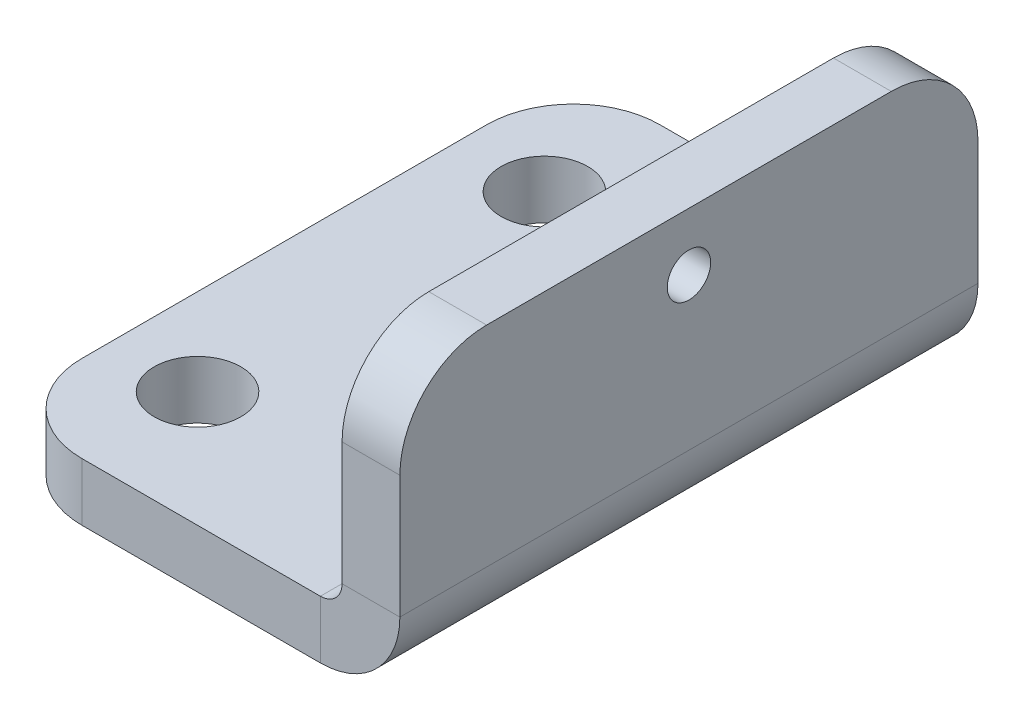
ISO-10303-21;
HEADER;
FILE_DESCRIPTION(('STEP AP214'),'2;1');
FILE_NAME('part.step','',(''),(''),'','','');
FILE_SCHEMA(('AUTOMOTIVE_DESIGN { 1 0 10303 214 1 1 1 1 }'));
ENDSEC;
DATA;
#1=APPLICATION_CONTEXT('core data for automotive mechanical design processes');
#2=APPLICATION_PROTOCOL_DEFINITION('international standard','automotive_design',2000,#1);
#3=PRODUCT_CONTEXT('',#1,'mechanical');
#4=PRODUCT('Part','Part','',(#3));
#5=PRODUCT_RELATED_PRODUCT_CATEGORY('part','',(#4));
#6=PRODUCT_DEFINITION_FORMATION('','',#4);
#7=PRODUCT_DEFINITION_CONTEXT('part definition',#1,'design');
#8=PRODUCT_DEFINITION('design','',#6,#7);
#9=PRODUCT_DEFINITION_SHAPE('','',#8);
#10=(LENGTH_UNIT() NAMED_UNIT(*) SI_UNIT(.MILLI.,.METRE.));
#11=(NAMED_UNIT(*) PLANE_ANGLE_UNIT() SI_UNIT($,.RADIAN.));
#12=(NAMED_UNIT(*) SI_UNIT($,.STERADIAN.) SOLID_ANGLE_UNIT());
#13=UNCERTAINTY_MEASURE_WITH_UNIT(LENGTH_MEASURE(1.E-05),#10,'distance_accuracy_value','');
#14=(GEOMETRIC_REPRESENTATION_CONTEXT(3) GLOBAL_UNCERTAINTY_ASSIGNED_CONTEXT((#13)) GLOBAL_UNIT_ASSIGNED_CONTEXT((#10,
#11,#12)) REPRESENTATION_CONTEXT('',''));
#15=CARTESIAN_POINT('',(0.,0.,0.));
#16=DIRECTION('',(0.,0.,1.));
#17=DIRECTION('',(1.,0.,0.));
#18=AXIS2_PLACEMENT_3D('',#15,#16,#17);
#19=CARTESIAN_POINT('',(0.,0.75,10.));
#20=DIRECTION('',(0.,0.,1.));
#21=DIRECTION('',(1.,0.,0.));
#22=AXIS2_PLACEMENT_3D('',#19,#20,#21);
#23=PLANE('',#22);
#24=DIRECTION('',(1.,0.,0.));
#25=VECTOR('',#24,1.);
#26=CARTESIAN_POINT('',(0.,0.75,10.));
#27=LINE('',#26,#25);
#28=CARTESIAN_POINT('',(0.,0.75,10.));
#29=VERTEX_POINT('',#28);
#30=CARTESIAN_POINT('',(2.,0.75,10.));
#31=VERTEX_POINT('',#30);
#32=EDGE_CURVE('E130',#29,#31,#27,.T.);
#33=ORIENTED_EDGE('',*,*,#32,.F.);
#34=CARTESIAN_POINT('',(-0.75,0.75,10.));
#35=DIRECTION('',(0.,0.,-1.));
#36=DIRECTION('',(-1.,0.,0.));
#37=AXIS2_PLACEMENT_3D('',#34,#35,#36);
#38=CIRCLE('',#37,0.75);
#39=CARTESIAN_POINT('',(-0.750000000000001,0.,10.));
#40=VERTEX_POINT('',#39);
#41=EDGE_CURVE('E134',#40,#29,#38,.F.);
#42=ORIENTED_EDGE('',*,*,#41,.F.);
#43=DIRECTION('',(0.,1.,0.));
#44=VECTOR('',#43,1.);
#45=CARTESIAN_POINT('',(-0.750000000000001,-2.,10.));
#46=LINE('',#45,#44);
#47=CARTESIAN_POINT('',(-0.750000000000001,-2.,10.));
#48=VERTEX_POINT('',#47);
#49=EDGE_CURVE('E139',#48,#40,#46,.T.);
#50=ORIENTED_EDGE('',*,*,#49,.F.);
#51=CARTESIAN_POINT('',(-0.75,0.75,10.));
#52=DIRECTION('',(0.,0.,1.));
#53=DIRECTION('',(1.,0.,0.));
#54=AXIS2_PLACEMENT_3D('',#51,#52,#53);
#55=CIRCLE('',#54,2.75);
#56=EDGE_CURVE('E136',#48,#31,#55,.T.);
#57=ORIENTED_EDGE('',*,*,#56,.T.);
#58=EDGE_LOOP('',(#33,#42,#50,#57));
#59=FACE_BOUND('',#58,.T.);
#60=ADVANCED_FACE('F39',(#59),#23,.T.);
#61=CARTESIAN_POINT('',(-0.750000000000001,-2.,10.));
#62=DIRECTION('',(0.,0.,1.));
#63=DIRECTION('',(1.,0.,0.));
#64=AXIS2_PLACEMENT_3D('',#61,#62,#63);
#65=PLANE('',#64);
#66=DIRECTION('',(0.,1.,0.));
#67=VECTOR('',#66,1.);
#68=CARTESIAN_POINT('',(2.,0.,10.));
#69=LINE('',#68,#67);
#70=CARTESIAN_POINT('',(2.,5.,10.));
#71=VERTEX_POINT('',#70);
#72=EDGE_CURVE('E157',#31,#71,#69,.T.);
#73=ORIENTED_EDGE('',*,*,#72,.T.);
#74=DIRECTION('',(1.,0.,0.));
#75=VECTOR('',#74,1.);
#76=CARTESIAN_POINT('',(-0.750000000000001,5.,10.));
#77=LINE('',#76,#75);
#78=CARTESIAN_POINT('',(0.,5.,10.));
#79=VERTEX_POINT('',#78);
#80=EDGE_CURVE('E11',#71,#79,#77,.F.);
#81=ORIENTED_EDGE('',*,*,#80,.T.);
#82=DIRECTION('',(0.,1.,0.));
#83=VECTOR('',#82,1.);
#84=CARTESIAN_POINT('',(0.,0.,10.));
#85=LINE('',#84,#83);
#86=EDGE_CURVE('E146',#29,#79,#85,.T.);
#87=ORIENTED_EDGE('',*,*,#86,.F.);
#88=ORIENTED_EDGE('',*,*,#32,.T.);
#89=EDGE_LOOP('',(#73,#81,#87,#88));
#90=FACE_BOUND('',#89,.T.);
#91=ADVANCED_FACE('F156',(#90),#65,.T.);
#92=CARTESIAN_POINT('',(-0.750000000000001,0.,-10.));
#93=DIRECTION('',(0.,0.,-1.));
#94=DIRECTION('',(-1.,0.,0.));
#95=AXIS2_PLACEMENT_3D('',#92,#93,#94);
#96=PLANE('',#95);
#97=DIRECTION('',(0.,-1.,0.));
#98=VECTOR('',#97,1.);
#99=CARTESIAN_POINT('',(-0.750000000000001,0.,-10.));
#100=LINE('',#99,#98);
#101=CARTESIAN_POINT('',(-0.750000000000001,0.,-10.));
#102=VERTEX_POINT('',#101);
#103=CARTESIAN_POINT('',(-0.750000000000001,-2.,-10.));
#104=VERTEX_POINT('',#103);
#105=EDGE_CURVE('E202',#102,#104,#100,.T.);
#106=ORIENTED_EDGE('',*,*,#105,.F.);
#107=CARTESIAN_POINT('',(-0.75,0.75,-10.));
#108=DIRECTION('',(0.,0.,-1.));
#109=DIRECTION('',(-1.,0.,0.));
#110=AXIS2_PLACEMENT_3D('',#107,#108,#109);
#111=CIRCLE('',#110,0.75);
#112=CARTESIAN_POINT('',(0.,0.75,-10.));
#113=VERTEX_POINT('',#112);
#114=EDGE_CURVE('E176',#102,#113,#111,.F.);
#115=ORIENTED_EDGE('',*,*,#114,.T.);
#116=DIRECTION('',(-1.,0.,0.));
#117=VECTOR('',#116,1.);
#118=CARTESIAN_POINT('',(2.,0.75,-10.));
#119=LINE('',#118,#117);
#120=CARTESIAN_POINT('',(2.,0.75,-10.));
#121=VERTEX_POINT('',#120);
#122=EDGE_CURVE('E200',#121,#113,#119,.T.);
#123=ORIENTED_EDGE('',*,*,#122,.F.);
#124=CARTESIAN_POINT('',(-0.75,0.75,-10.));
#125=DIRECTION('',(0.,0.,1.));
#126=DIRECTION('',(1.,0.,0.));
#127=AXIS2_PLACEMENT_3D('',#124,#125,#126);
#128=CIRCLE('',#127,2.75);
#129=EDGE_CURVE('E182',#104,#121,#128,.T.);
#130=ORIENTED_EDGE('',*,*,#129,.F.);
#131=EDGE_LOOP('',(#106,#115,#123,#130));
#132=FACE_BOUND('',#131,.T.);
#133=ADVANCED_FACE('F291',(#132),#96,.T.);
#134=CARTESIAN_POINT('',(2.,0.75,-10.));
#135=DIRECTION('',(0.,0.,-1.));
#136=DIRECTION('',(-1.,0.,0.));
#137=AXIS2_PLACEMENT_3D('',#134,#135,#136);
#138=PLANE('',#137);
#139=DIRECTION('',(1.,0.,0.));
#140=VECTOR('',#139,1.);
#141=CARTESIAN_POINT('',(-12.,-2.,-10.));
#142=LINE('',#141,#140);
#143=CARTESIAN_POINT('',(-9.,-2.,-10.));
#144=VERTEX_POINT('',#143);
#145=EDGE_CURVE('E180',#144,#104,#142,.T.);
#146=ORIENTED_EDGE('',*,*,#145,.F.);
#147=DIRECTION('',(0.,1.,0.));
#148=VECTOR('',#147,1.);
#149=CARTESIAN_POINT('',(-9.,0.75,-10.));
#150=LINE('',#149,#148);
#151=CARTESIAN_POINT('',(-9.,0.,-10.));
#152=VERTEX_POINT('',#151);
#153=EDGE_CURVE('E138',#144,#152,#150,.T.);
#154=ORIENTED_EDGE('',*,*,#153,.T.);
#155=DIRECTION('',(1.,0.,0.));
#156=VECTOR('',#155,1.);
#157=CARTESIAN_POINT('',(-12.,0.,-10.));
#158=LINE('',#157,#156);
#159=EDGE_CURVE('E178',#152,#102,#158,.T.);
#160=ORIENTED_EDGE('',*,*,#159,.T.);
#161=ORIENTED_EDGE('',*,*,#105,.T.);
#162=EDGE_LOOP('',(#146,#154,#160,#161));
#163=FACE_BOUND('',#162,.T.);
#164=ADVANCED_FACE('F351',(#163),#138,.T.);
#165=CARTESIAN_POINT('',(2.,0.,10.));
#166=DIRECTION('',(-1.,0.,0.));
#167=DIRECTION('',(0.,0.,1.));
#168=AXIS2_PLACEMENT_3D('',#165,#166,#167);
#169=PLANE('',#168);
#170=CARTESIAN_POINT('',(2.,6.,0.));
#171=DIRECTION('',(-1.,0.,0.));
#172=DIRECTION('',(0.,0.,1.));
#173=AXIS2_PLACEMENT_3D('',#170,#171,#172);
#174=CIRCLE('',#173,0.75);
#175=CARTESIAN_POINT('',(2.,6.,0.75));
#176=VERTEX_POINT('',#175);
#177=EDGE_CURVE('E255',#176,#176,#174,.T.);
#178=ORIENTED_EDGE('',*,*,#177,.T.);
#179=EDGE_LOOP('',(#178));
#180=FACE_BOUND('',#179,.T.);
#181=DIRECTION('',(0.,1.,0.));
#182=VECTOR('',#181,1.);
#183=CARTESIAN_POINT('',(2.,0.,-10.));
#184=LINE('',#183,#182);
#185=CARTESIAN_POINT('',(2.,5.,-10.));
#186=VERTEX_POINT('',#185);
#187=EDGE_CURVE('E171',#121,#186,#184,.T.);
#188=ORIENTED_EDGE('',*,*,#187,.T.);
#189=CARTESIAN_POINT('',(2.,5.,-7.));
#190=DIRECTION('',(-1.,0.,0.));
#191=DIRECTION('',(0.,0.,1.));
#192=AXIS2_PLACEMENT_3D('',#189,#190,#191);
#193=CIRCLE('',#192,3.);
#194=CARTESIAN_POINT('',(2.,8.,-7.));
#195=VERTEX_POINT('',#194);
#196=EDGE_CURVE('E229',#186,#195,#193,.F.);
#197=ORIENTED_EDGE('',*,*,#196,.T.);
#198=DIRECTION('',(0.,0.,-1.));
#199=VECTOR('',#198,1.);
#200=CARTESIAN_POINT('',(2.,8.,10.));
#201=LINE('',#200,#199);
#202=CARTESIAN_POINT('',(2.,8.,7.));
#203=VERTEX_POINT('',#202);
#204=EDGE_CURVE('E198',#203,#195,#201,.T.);
#205=ORIENTED_EDGE('',*,*,#204,.F.);
#206=CARTESIAN_POINT('',(2.,5.,7.));
#207=DIRECTION('',(-1.,0.,0.));
#208=DIRECTION('',(0.,0.,1.));
#209=AXIS2_PLACEMENT_3D('',#206,#207,#208);
#210=CIRCLE('',#209,3.);
#211=EDGE_CURVE('E227',#203,#71,#210,.F.);
#212=ORIENTED_EDGE('',*,*,#211,.T.);
#213=ORIENTED_EDGE('',*,*,#72,.F.);
#214=DIRECTION('',(0.,0.,-1.));
#215=VECTOR('',#214,1.);
#216=CARTESIAN_POINT('',(2.,0.75,10.));
#217=LINE('',#216,#215);
#218=EDGE_CURVE('E170',#31,#121,#217,.T.);
#219=ORIENTED_EDGE('',*,*,#218,.T.);
#220=EDGE_LOOP('',(#188,#197,#205,#212,#213,#219));
#221=FACE_BOUND('',#220,.T.);
#222=ADVANCED_FACE('F245',(#180,#221),#169,.F.);
#223=CARTESIAN_POINT('',(0.,8.,10.));
#224=DIRECTION('',(0.,1.,0.));
#225=DIRECTION('',(0.,0.,1.));
#226=AXIS2_PLACEMENT_3D('',#223,#224,#225);
#227=PLANE('',#226);
#228=ORIENTED_EDGE('',*,*,#204,.T.);
#229=DIRECTION('',(1.,0.,0.));
#230=VECTOR('',#229,1.);
#231=CARTESIAN_POINT('',(0.,8.,-7.));
#232=LINE('',#231,#230);
#233=CARTESIAN_POINT('',(0.,8.,-7.));
#234=VERTEX_POINT('',#233);
#235=EDGE_CURVE('E60',#195,#234,#232,.F.);
#236=ORIENTED_EDGE('',*,*,#235,.T.);
#237=DIRECTION('',(0.,0.,-1.));
#238=VECTOR('',#237,1.);
#239=CARTESIAN_POINT('',(0.,8.,10.));
#240=LINE('',#239,#238);
#241=CARTESIAN_POINT('',(0.,8.,7.));
#242=VERTEX_POINT('',#241);
#243=EDGE_CURVE('E153',#242,#234,#240,.T.);
#244=ORIENTED_EDGE('',*,*,#243,.F.);
#245=DIRECTION('',(1.,0.,0.));
#246=VECTOR('',#245,1.);
#247=CARTESIAN_POINT('',(0.,8.,7.));
#248=LINE('',#247,#246);
#249=EDGE_CURVE('E231',#242,#203,#248,.T.);
#250=ORIENTED_EDGE('',*,*,#249,.T.);
#251=EDGE_LOOP('',(#228,#236,#244,#250));
#252=FACE_BOUND('',#251,.T.);
#253=ADVANCED_FACE('F246',(#252),#227,.T.);
#254=CARTESIAN_POINT('',(0.,0.,10.));
#255=DIRECTION('',(-1.,0.,0.));
#256=DIRECTION('',(0.,0.,1.));
#257=AXIS2_PLACEMENT_3D('',#254,#255,#256);
#258=PLANE('',#257);
#259=CARTESIAN_POINT('',(0.,6.,0.));
#260=DIRECTION('',(-1.,0.,0.));
#261=DIRECTION('',(0.,0.,1.));
#262=AXIS2_PLACEMENT_3D('',#259,#260,#261);
#263=CIRCLE('',#262,0.75);
#264=CARTESIAN_POINT('',(0.,6.,0.75));
#265=VERTEX_POINT('',#264);
#266=EDGE_CURVE('E263',#265,#265,#263,.T.);
#267=ORIENTED_EDGE('',*,*,#266,.F.);
#268=EDGE_LOOP('',(#267));
#269=FACE_BOUND('',#268,.T.);
#270=ORIENTED_EDGE('',*,*,#243,.T.);
#271=CARTESIAN_POINT('',(0.,5.,-7.));
#272=DIRECTION('',(-1.,0.,0.));
#273=DIRECTION('',(0.,0.,1.));
#274=AXIS2_PLACEMENT_3D('',#271,#272,#273);
#275=CIRCLE('',#274,3.);
#276=CARTESIAN_POINT('',(0.,5.,-10.));
#277=VERTEX_POINT('',#276);
#278=EDGE_CURVE('E47',#234,#277,#275,.T.);
#279=ORIENTED_EDGE('',*,*,#278,.T.);
#280=DIRECTION('',(0.,1.,0.));
#281=VECTOR('',#280,1.);
#282=CARTESIAN_POINT('',(0.,0.,-10.));
#283=LINE('',#282,#281);
#284=EDGE_CURVE('E149',#113,#277,#283,.T.);
#285=ORIENTED_EDGE('',*,*,#284,.F.);
#286=DIRECTION('',(0.,0.,-1.));
#287=VECTOR('',#286,1.);
#288=CARTESIAN_POINT('',(0.,0.75,10.));
#289=LINE('',#288,#287);
#290=EDGE_CURVE('E144',#29,#113,#289,.T.);
#291=ORIENTED_EDGE('',*,*,#290,.F.);
#292=ORIENTED_EDGE('',*,*,#86,.T.);
#293=CARTESIAN_POINT('',(0.,5.,7.));
#294=DIRECTION('',(-1.,0.,0.));
#295=DIRECTION('',(0.,0.,1.));
#296=AXIS2_PLACEMENT_3D('',#293,#294,#295);
#297=CIRCLE('',#296,3.);
#298=EDGE_CURVE('E235',#79,#242,#297,.T.);
#299=ORIENTED_EDGE('',*,*,#298,.T.);
#300=EDGE_LOOP('',(#270,#279,#285,#291,#292,#299));
#301=FACE_BOUND('',#300,.T.);
#302=ADVANCED_FACE('F145',(#269,#301),#258,.T.);
#303=CARTESIAN_POINT('',(-0.75,0.75,10.));
#304=DIRECTION('',(0.,0.,-1.));
#305=DIRECTION('',(-1.,0.,0.));
#306=AXIS2_PLACEMENT_3D('',#303,#304,#305);
#307=CYLINDRICAL_SURFACE('',#306,0.75);
#308=ORIENTED_EDGE('',*,*,#114,.F.);
#309=DIRECTION('',(0.,0.,-1.));
#310=VECTOR('',#309,1.);
#311=CARTESIAN_POINT('',(-0.750000000000001,0.,10.));
#312=LINE('',#311,#310);
#313=EDGE_CURVE('E154',#40,#102,#312,.T.);
#314=ORIENTED_EDGE('',*,*,#313,.F.);
#315=ORIENTED_EDGE('',*,*,#41,.T.);
#316=ORIENTED_EDGE('',*,*,#290,.T.);
#317=EDGE_LOOP('',(#308,#314,#315,#316));
#318=FACE_BOUND('',#317,.T.);
#319=ADVANCED_FACE('F160',(#318),#307,.F.);
#320=CARTESIAN_POINT('',(-12.,0.,10.));
#321=DIRECTION('',(0.,1.,0.));
#322=DIRECTION('',(0.,0.,1.));
#323=AXIS2_PLACEMENT_3D('',#320,#321,#322);
#324=PLANE('',#323);
#325=CARTESIAN_POINT('',(-9.,0.,-6.));
#326=DIRECTION('',(0.,1.,0.));
#327=DIRECTION('',(0.,0.,1.));
#328=AXIS2_PLACEMENT_3D('',#325,#326,#327);
#329=CIRCLE('',#328,1.5);
#330=CARTESIAN_POINT('',(-9.,0.,-4.5));
#331=VERTEX_POINT('',#330);
#332=EDGE_CURVE('E258',#331,#331,#329,.T.);
#333=ORIENTED_EDGE('',*,*,#332,.F.);
#334=EDGE_LOOP('',(#333));
#335=FACE_BOUND('',#334,.T.);
#336=CARTESIAN_POINT('',(-9.,0.,6.));
#337=DIRECTION('',(0.,1.,0.));
#338=DIRECTION('',(0.,0.,-1.));
#339=AXIS2_PLACEMENT_3D('',#336,#337,#338);
#340=CIRCLE('',#339,1.5);
#341=CARTESIAN_POINT('',(-9.,0.,4.5));
#342=VERTEX_POINT('',#341);
#343=EDGE_CURVE('E251',#342,#342,#340,.T.);
#344=ORIENTED_EDGE('',*,*,#343,.F.);
#345=EDGE_LOOP('',(#344));
#346=FACE_BOUND('',#345,.T.);
#347=ORIENTED_EDGE('',*,*,#159,.F.);
#348=CARTESIAN_POINT('',(-9.,0.,-7.));
#349=DIRECTION('',(0.,1.,0.));
#350=DIRECTION('',(0.,0.,1.));
#351=AXIS2_PLACEMENT_3D('',#348,#349,#350);
#352=CIRCLE('',#351,3.);
#353=CARTESIAN_POINT('',(-12.,0.,-7.));
#354=VERTEX_POINT('',#353);
#355=EDGE_CURVE('E211',#152,#354,#352,.T.);
#356=ORIENTED_EDGE('',*,*,#355,.T.);
#357=DIRECTION('',(0.,0.,-1.));
#358=VECTOR('',#357,1.);
#359=CARTESIAN_POINT('',(-12.,0.,10.));
#360=LINE('',#359,#358);
#361=CARTESIAN_POINT('',(-12.,0.,7.));
#362=VERTEX_POINT('',#361);
#363=EDGE_CURVE('E193',#362,#354,#360,.T.);
#364=ORIENTED_EDGE('',*,*,#363,.F.);
#365=CARTESIAN_POINT('',(-9.,0.,7.));
#366=DIRECTION('',(0.,1.,0.));
#367=DIRECTION('',(0.,0.,1.));
#368=AXIS2_PLACEMENT_3D('',#365,#366,#367);
#369=CIRCLE('',#368,3.);
#370=CARTESIAN_POINT('',(-9.,0.,10.));
#371=VERTEX_POINT('',#370);
#372=EDGE_CURVE('E209',#362,#371,#369,.T.);
#373=ORIENTED_EDGE('',*,*,#372,.T.);
#374=DIRECTION('',(1.,0.,0.));
#375=VECTOR('',#374,1.);
#376=CARTESIAN_POINT('',(-12.,0.,10.));
#377=LINE('',#376,#375);
#378=EDGE_CURVE('E162',#371,#40,#377,.T.);
#379=ORIENTED_EDGE('',*,*,#378,.T.);
#380=ORIENTED_EDGE('',*,*,#313,.T.);
#381=EDGE_LOOP('',(#347,#356,#364,#373,#379,#380));
#382=FACE_BOUND('',#381,.T.);
#383=ADVANCED_FACE('F283',(#335,#346,#382),#324,.T.);
#384=CARTESIAN_POINT('',(-12.,-2.,10.));
#385=DIRECTION('',(-1.,0.,0.));
#386=DIRECTION('',(0.,0.,1.));
#387=AXIS2_PLACEMENT_3D('',#384,#385,#386);
#388=PLANE('',#387);
#389=ORIENTED_EDGE('',*,*,#363,.T.);
#390=DIRECTION('',(0.,1.,0.));
#391=VECTOR('',#390,1.);
#392=CARTESIAN_POINT('',(-12.,-2.,-7.));
#393=LINE('',#392,#391);
#394=CARTESIAN_POINT('',(-12.,-2.,-7.));
#395=VERTEX_POINT('',#394);
#396=EDGE_CURVE('E216',#354,#395,#393,.F.);
#397=ORIENTED_EDGE('',*,*,#396,.T.);
#398=DIRECTION('',(0.,0.,-1.));
#399=VECTOR('',#398,1.);
#400=CARTESIAN_POINT('',(-12.,-2.,10.));
#401=LINE('',#400,#399);
#402=CARTESIAN_POINT('',(-12.,-2.,7.));
#403=VERTEX_POINT('',#402);
#404=EDGE_CURVE('E190',#403,#395,#401,.T.);
#405=ORIENTED_EDGE('',*,*,#404,.F.);
#406=DIRECTION('',(0.,1.,0.));
#407=VECTOR('',#406,1.);
#408=CARTESIAN_POINT('',(-12.,0.,7.));
#409=LINE('',#408,#407);
#410=EDGE_CURVE('E213',#403,#362,#409,.T.);
#411=ORIENTED_EDGE('',*,*,#410,.T.);
#412=EDGE_LOOP('',(#389,#397,#405,#411));
#413=FACE_BOUND('',#412,.T.);
#414=ADVANCED_FACE('F333',(#413),#388,.T.);
#415=CARTESIAN_POINT('',(-12.,-2.,10.));
#416=DIRECTION('',(0.,1.,0.));
#417=DIRECTION('',(0.,0.,1.));
#418=AXIS2_PLACEMENT_3D('',#415,#416,#417);
#419=PLANE('',#418);
#420=CARTESIAN_POINT('',(-9.,-2.,-6.));
#421=DIRECTION('',(0.,1.,0.));
#422=DIRECTION('',(0.,0.,1.));
#423=AXIS2_PLACEMENT_3D('',#420,#421,#422);
#424=CIRCLE('',#423,1.5);
#425=CARTESIAN_POINT('',(-9.,-2.,-4.5));
#426=VERTEX_POINT('',#425);
#427=EDGE_CURVE('E174',#426,#426,#424,.T.);
#428=ORIENTED_EDGE('',*,*,#427,.T.);
#429=EDGE_LOOP('',(#428));
#430=FACE_BOUND('',#429,.T.);
#431=CARTESIAN_POINT('',(-9.,-2.,6.));
#432=DIRECTION('',(0.,1.,0.));
#433=DIRECTION('',(0.,0.,-1.));
#434=AXIS2_PLACEMENT_3D('',#431,#432,#433);
#435=CIRCLE('',#434,1.5);
#436=CARTESIAN_POINT('',(-9.,-2.,4.5));
#437=VERTEX_POINT('',#436);
#438=EDGE_CURVE('E254',#437,#437,#435,.T.);
#439=ORIENTED_EDGE('',*,*,#438,.T.);
#440=EDGE_LOOP('',(#439));
#441=FACE_BOUND('',#440,.T.);
#442=ORIENTED_EDGE('',*,*,#404,.T.);
#443=CARTESIAN_POINT('',(-9.,-2.,-7.));
#444=DIRECTION('',(0.,1.,0.));
#445=DIRECTION('',(0.,0.,1.));
#446=AXIS2_PLACEMENT_3D('',#443,#444,#445);
#447=CIRCLE('',#446,3.);
#448=EDGE_CURVE('E220',#395,#144,#447,.F.);
#449=ORIENTED_EDGE('',*,*,#448,.T.);
#450=ORIENTED_EDGE('',*,*,#145,.T.);
#451=DIRECTION('',(0.,0.,-1.));
#452=VECTOR('',#451,1.);
#453=CARTESIAN_POINT('',(-0.750000000000001,-2.,10.));
#454=LINE('',#453,#452);
#455=EDGE_CURVE('E187',#48,#104,#454,.T.);
#456=ORIENTED_EDGE('',*,*,#455,.F.);
#457=DIRECTION('',(1.,0.,0.));
#458=VECTOR('',#457,1.);
#459=CARTESIAN_POINT('',(-12.,-2.,10.));
#460=LINE('',#459,#458);
#461=CARTESIAN_POINT('',(-9.,-2.,10.));
#462=VERTEX_POINT('',#461);
#463=EDGE_CURVE('E164',#462,#48,#460,.T.);
#464=ORIENTED_EDGE('',*,*,#463,.F.);
#465=CARTESIAN_POINT('',(-9.,-2.,7.));
#466=DIRECTION('',(0.,1.,0.));
#467=DIRECTION('',(0.,0.,1.));
#468=AXIS2_PLACEMENT_3D('',#465,#466,#467);
#469=CIRCLE('',#468,3.);
#470=EDGE_CURVE('E218',#462,#403,#469,.F.);
#471=ORIENTED_EDGE('',*,*,#470,.T.);
#472=EDGE_LOOP('',(#442,#449,#450,#456,#464,#471));
#473=FACE_BOUND('',#472,.T.);
#474=ADVANCED_FACE('F329',(#430,#441,#473),#419,.F.);
#475=CARTESIAN_POINT('',(-0.75,0.75,10.));
#476=DIRECTION('',(0.,0.,-1.));
#477=DIRECTION('',(-1.,0.,0.));
#478=AXIS2_PLACEMENT_3D('',#475,#476,#477);
#479=CYLINDRICAL_SURFACE('',#478,2.75);
#480=ORIENTED_EDGE('',*,*,#129,.T.);
#481=ORIENTED_EDGE('',*,*,#218,.F.);
#482=ORIENTED_EDGE('',*,*,#56,.F.);
#483=ORIENTED_EDGE('',*,*,#455,.T.);
#484=EDGE_LOOP('',(#480,#481,#482,#483));
#485=FACE_BOUND('',#484,.T.);
#486=ADVANCED_FACE('F323',(#485),#479,.T.);
#487=CARTESIAN_POINT('',(-0.75,0.75,10.));
#488=DIRECTION('',(0.,0.,-1.));
#489=DIRECTION('',(-1.,0.,0.));
#490=AXIS2_PLACEMENT_3D('',#487,#488,#489);
#491=PLANE('',#490);
#492=ORIENTED_EDGE('',*,*,#378,.F.);
#493=DIRECTION('',(0.,1.,0.));
#494=VECTOR('',#493,1.);
#495=CARTESIAN_POINT('',(-9.,-2.,10.));
#496=LINE('',#495,#494);
#497=EDGE_CURVE('E222',#371,#462,#496,.F.);
#498=ORIENTED_EDGE('',*,*,#497,.T.);
#499=ORIENTED_EDGE('',*,*,#463,.T.);
#500=ORIENTED_EDGE('',*,*,#49,.T.);
#501=EDGE_LOOP('',(#492,#498,#499,#500));
#502=FACE_BOUND('',#501,.T.);
#503=ADVANCED_FACE('F320',(#502),#491,.F.);
#504=CARTESIAN_POINT('',(-0.75,0.75,-10.));
#505=DIRECTION('',(0.,0.,-1.));
#506=DIRECTION('',(-1.,0.,0.));
#507=AXIS2_PLACEMENT_3D('',#504,#505,#506);
#508=PLANE('',#507);
#509=ORIENTED_EDGE('',*,*,#284,.T.);
#510=DIRECTION('',(1.,0.,0.));
#511=VECTOR('',#510,1.);
#512=CARTESIAN_POINT('',(-0.75,5.,-10.));
#513=LINE('',#512,#511);
#514=EDGE_CURVE('E224',#277,#186,#513,.T.);
#515=ORIENTED_EDGE('',*,*,#514,.T.);
#516=ORIENTED_EDGE('',*,*,#187,.F.);
#517=ORIENTED_EDGE('',*,*,#122,.T.);
#518=EDGE_LOOP('',(#509,#515,#516,#517));
#519=FACE_BOUND('',#518,.T.);
#520=ADVANCED_FACE('F240',(#519),#508,.T.);
#521=CARTESIAN_POINT('',(-9.,0.75,-7.));
#522=DIRECTION('',(0.,1.,0.));
#523=DIRECTION('',(0.,0.,1.));
#524=AXIS2_PLACEMENT_3D('',#521,#522,#523);
#525=CYLINDRICAL_SURFACE('',#524,3.);
#526=ORIENTED_EDGE('',*,*,#448,.F.);
#527=ORIENTED_EDGE('',*,*,#396,.F.);
#528=ORIENTED_EDGE('',*,*,#355,.F.);
#529=ORIENTED_EDGE('',*,*,#153,.F.);
#530=EDGE_LOOP('',(#526,#527,#528,#529));
#531=FACE_BOUND('',#530,.T.);
#532=ADVANCED_FACE('F295',(#531),#525,.T.);
#533=CARTESIAN_POINT('',(-9.,-2.,7.));
#534=DIRECTION('',(0.,-1.,0.));
#535=DIRECTION('',(0.,0.,-1.));
#536=AXIS2_PLACEMENT_3D('',#533,#534,#535);
#537=CYLINDRICAL_SURFACE('',#536,3.);
#538=ORIENTED_EDGE('',*,*,#470,.F.);
#539=ORIENTED_EDGE('',*,*,#497,.F.);
#540=ORIENTED_EDGE('',*,*,#372,.F.);
#541=ORIENTED_EDGE('',*,*,#410,.F.);
#542=EDGE_LOOP('',(#538,#539,#540,#541));
#543=FACE_BOUND('',#542,.T.);
#544=ADVANCED_FACE('F298',(#543),#537,.T.);
#545=CARTESIAN_POINT('',(-0.75,5.,-7.));
#546=DIRECTION('',(1.,0.,0.));
#547=DIRECTION('',(0.,0.,-1.));
#548=AXIS2_PLACEMENT_3D('',#545,#546,#547);
#549=CYLINDRICAL_SURFACE('',#548,3.);
#550=ORIENTED_EDGE('',*,*,#278,.F.);
#551=ORIENTED_EDGE('',*,*,#235,.F.);
#552=ORIENTED_EDGE('',*,*,#196,.F.);
#553=ORIENTED_EDGE('',*,*,#514,.F.);
#554=EDGE_LOOP('',(#550,#551,#552,#553));
#555=FACE_BOUND('',#554,.T.);
#556=ADVANCED_FACE('F242',(#555),#549,.T.);
#557=CARTESIAN_POINT('',(0.,5.,7.));
#558=DIRECTION('',(1.,0.,0.));
#559=DIRECTION('',(0.,0.,-1.));
#560=AXIS2_PLACEMENT_3D('',#557,#558,#559);
#561=CYLINDRICAL_SURFACE('',#560,3.);
#562=ORIENTED_EDGE('',*,*,#298,.F.);
#563=ORIENTED_EDGE('',*,*,#80,.F.);
#564=ORIENTED_EDGE('',*,*,#211,.F.);
#565=ORIENTED_EDGE('',*,*,#249,.F.);
#566=EDGE_LOOP('',(#562,#563,#564,#565));
#567=FACE_BOUND('',#566,.T.);
#568=ADVANCED_FACE('F41',(#567),#561,.T.);
#569=CARTESIAN_POINT('',(-9.,-2.,6.));
#570=DIRECTION('',(0.,1.,0.));
#571=DIRECTION('',(0.,0.,1.));
#572=AXIS2_PLACEMENT_3D('',#569,#570,#571);
#573=CYLINDRICAL_SURFACE('',#572,1.5);
#574=ORIENTED_EDGE('',*,*,#438,.F.);
#575=EDGE_LOOP('',(#574));
#576=FACE_BOUND('',#575,.T.);
#577=ORIENTED_EDGE('',*,*,#343,.T.);
#578=EDGE_LOOP('',(#577));
#579=FACE_BOUND('',#578,.T.);
#580=ADVANCED_FACE('F306',(#576,#579),#573,.F.);
#581=CARTESIAN_POINT('',(-9.,-2.,-6.));
#582=DIRECTION('',(0.,1.,0.));
#583=DIRECTION('',(0.,0.,1.));
#584=AXIS2_PLACEMENT_3D('',#581,#582,#583);
#585=CYLINDRICAL_SURFACE('',#584,1.5);
#586=ORIENTED_EDGE('',*,*,#427,.F.);
#587=EDGE_LOOP('',(#586));
#588=FACE_BOUND('',#587,.T.);
#589=ORIENTED_EDGE('',*,*,#332,.T.);
#590=EDGE_LOOP('',(#589));
#591=FACE_BOUND('',#590,.T.);
#592=ADVANCED_FACE('F273',(#588,#591),#585,.F.);
#593=CARTESIAN_POINT('',(2.,6.,0.));
#594=DIRECTION('',(-1.,0.,0.));
#595=DIRECTION('',(0.,0.,1.));
#596=AXIS2_PLACEMENT_3D('',#593,#594,#595);
#597=CYLINDRICAL_SURFACE('',#596,0.75);
#598=ORIENTED_EDGE('',*,*,#177,.F.);
#599=EDGE_LOOP('',(#598));
#600=FACE_BOUND('',#599,.T.);
#601=ORIENTED_EDGE('',*,*,#266,.T.);
#602=EDGE_LOOP('',(#601));
#603=FACE_BOUND('',#602,.T.);
#604=ADVANCED_FACE('F270',(#600,#603),#597,.F.);
#605=CLOSED_SHELL('',(#60,#91,#133,#164,#222,#253,#302,#319,#383,#414,#474,#486,#503,#520,#532,
#544,#556,#568,#580,#592,#604));
#606=MANIFOLD_SOLID_BREP('B2',#605);
#607=ADVANCED_BREP_SHAPE_REPRESENTATION('',(#18,#606),#14);
#608=SHAPE_DEFINITION_REPRESENTATION(#9,#607);
ENDSEC;
END-ISO-10303-21;
